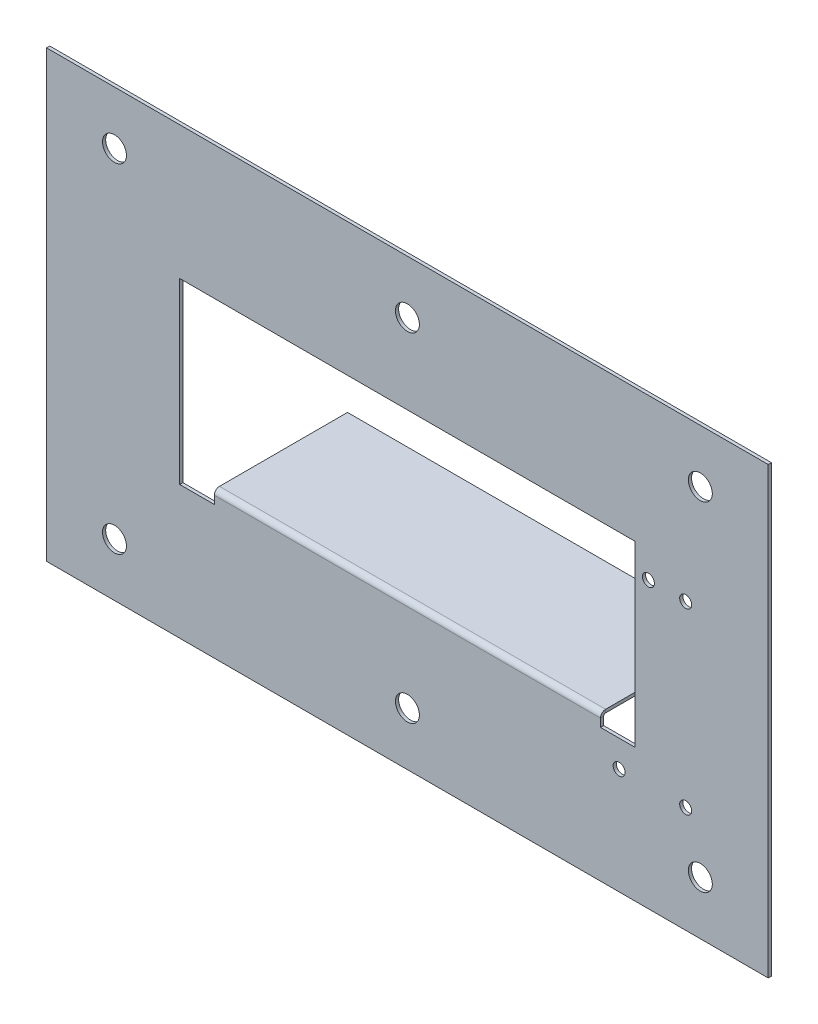
ISO-10303-21;
HEADER;
FILE_DESCRIPTION(('STEP AP214'),'2;1');
FILE_NAME('part.step','',(''),(''),'','','');
FILE_SCHEMA(('AUTOMOTIVE_DESIGN { 1 0 10303 214 1 1 1 1 }'));
ENDSEC;
DATA;
#1=APPLICATION_CONTEXT('core data for automotive mechanical design processes');
#2=APPLICATION_PROTOCOL_DEFINITION('international standard','automotive_design',2000,#1);
#3=PRODUCT_CONTEXT('',#1,'mechanical');
#4=PRODUCT('Part','Part','',(#3));
#5=PRODUCT_RELATED_PRODUCT_CATEGORY('part','',(#4));
#6=PRODUCT_DEFINITION_FORMATION('','',#4);
#7=PRODUCT_DEFINITION_CONTEXT('part definition',#1,'design');
#8=PRODUCT_DEFINITION('design','',#6,#7);
#9=PRODUCT_DEFINITION_SHAPE('','',#8);
#10=(LENGTH_UNIT() NAMED_UNIT(*) SI_UNIT(.MILLI.,.METRE.));
#11=(NAMED_UNIT(*) PLANE_ANGLE_UNIT() SI_UNIT($,.RADIAN.));
#12=(NAMED_UNIT(*) SI_UNIT($,.STERADIAN.) SOLID_ANGLE_UNIT());
#13=UNCERTAINTY_MEASURE_WITH_UNIT(LENGTH_MEASURE(1.E-05),#10,'distance_accuracy_value','');
#14=(GEOMETRIC_REPRESENTATION_CONTEXT(3) GLOBAL_UNCERTAINTY_ASSIGNED_CONTEXT((#13)) GLOBAL_UNIT_ASSIGNED_CONTEXT((#10,
#11,#12)) REPRESENTATION_CONTEXT('',''));
#15=CARTESIAN_POINT('',(0.,0.,0.));
#16=DIRECTION('',(0.,0.,1.));
#17=DIRECTION('',(1.,0.,0.));
#18=AXIS2_PLACEMENT_3D('',#15,#16,#17);
#19=CARTESIAN_POINT('',(-50.,114.,-1.2));
#20=DIRECTION('',(-1.,0.,0.));
#21=DIRECTION('',(0.,-1.,0.));
#22=AXIS2_PLACEMENT_3D('',#19,#20,#21);
#23=PLANE('',#22);
#24=DIRECTION('',(0.,-1.,0.));
#25=VECTOR('',#24,1.);
#26=CARTESIAN_POINT('',(-50.,114.,0.));
#27=LINE('',#26,#25);
#28=CARTESIAN_POINT('',(-50.,114.,0.));
#29=VERTEX_POINT('',#28);
#30=CARTESIAN_POINT('',(-50.,-53.,0.));
#31=VERTEX_POINT('',#30);
#32=EDGE_CURVE('E296',#29,#31,#27,.T.);
#33=ORIENTED_EDGE('',*,*,#32,.F.);
#34=DIRECTION('',(0.,0.,1.));
#35=VECTOR('',#34,1.);
#36=CARTESIAN_POINT('',(-50.,114.,-1.2));
#37=LINE('',#36,#35);
#38=CARTESIAN_POINT('',(-50.,114.,-1.2));
#39=VERTEX_POINT('',#38);
#40=EDGE_CURVE('E13',#39,#29,#37,.T.);
#41=ORIENTED_EDGE('',*,*,#40,.F.);
#42=DIRECTION('',(0.,-1.,0.));
#43=VECTOR('',#42,1.);
#44=CARTESIAN_POINT('',(-50.,114.,-1.2));
#45=LINE('',#44,#43);
#46=CARTESIAN_POINT('',(-50.,-53.,-1.2));
#47=VERTEX_POINT('',#46);
#48=EDGE_CURVE('E312',#39,#47,#45,.T.);
#49=ORIENTED_EDGE('',*,*,#48,.T.);
#50=DIRECTION('',(0.,0.,1.));
#51=VECTOR('',#50,1.);
#52=CARTESIAN_POINT('',(-50.,-53.,-1.2));
#53=LINE('',#52,#51);
#54=EDGE_CURVE('E62',#47,#31,#53,.T.);
#55=ORIENTED_EDGE('',*,*,#54,.T.);
#56=EDGE_LOOP('',(#33,#41,#49,#55));
#57=FACE_BOUND('',#56,.T.);
#58=ADVANCED_FACE('F59',(#57),#23,.T.);
#59=CARTESIAN_POINT('',(-50.,114.,-1.2));
#60=DIRECTION('',(0.,1.,0.));
#61=DIRECTION('',(0.,0.,1.));
#62=AXIS2_PLACEMENT_3D('',#59,#60,#61);
#63=PLANE('',#62);
#64=DIRECTION('',(-1.,0.,0.));
#65=VECTOR('',#64,1.);
#66=CARTESIAN_POINT('',(-50.,114.,0.));
#67=LINE('',#66,#65);
#68=CARTESIAN_POINT('',(221.,114.,0.));
#69=VERTEX_POINT('',#68);
#70=EDGE_CURVE('E316',#69,#29,#67,.T.);
#71=ORIENTED_EDGE('',*,*,#70,.F.);
#72=DIRECTION('',(0.,0.,1.));
#73=VECTOR('',#72,1.);
#74=CARTESIAN_POINT('',(221.,114.,-1.2));
#75=LINE('',#74,#73);
#76=CARTESIAN_POINT('',(221.,114.,-1.2));
#77=VERTEX_POINT('',#76);
#78=EDGE_CURVE('E67',#77,#69,#75,.T.);
#79=ORIENTED_EDGE('',*,*,#78,.F.);
#80=DIRECTION('',(-1.,0.,0.));
#81=VECTOR('',#80,1.);
#82=CARTESIAN_POINT('',(-50.,114.,-1.2));
#83=LINE('',#82,#81);
#84=EDGE_CURVE('E322',#77,#39,#83,.T.);
#85=ORIENTED_EDGE('',*,*,#84,.T.);
#86=ORIENTED_EDGE('',*,*,#40,.T.);
#87=EDGE_LOOP('',(#71,#79,#85,#86));
#88=FACE_BOUND('',#87,.T.);
#89=ADVANCED_FACE('F348',(#88),#63,.T.);
#90=CARTESIAN_POINT('',(221.,114.,-1.2));
#91=DIRECTION('',(1.,0.,0.));
#92=DIRECTION('',(0.,1.,0.));
#93=AXIS2_PLACEMENT_3D('',#90,#91,#92);
#94=PLANE('',#93);
#95=DIRECTION('',(0.,1.,0.));
#96=VECTOR('',#95,1.);
#97=CARTESIAN_POINT('',(221.,114.,0.));
#98=LINE('',#97,#96);
#99=CARTESIAN_POINT('',(221.,-53.,0.));
#100=VERTEX_POINT('',#99);
#101=EDGE_CURVE('E330',#100,#69,#98,.T.);
#102=ORIENTED_EDGE('',*,*,#101,.F.);
#103=DIRECTION('',(0.,0.,1.));
#104=VECTOR('',#103,1.);
#105=CARTESIAN_POINT('',(221.,-53.,-1.2));
#106=LINE('',#105,#104);
#107=CARTESIAN_POINT('',(221.,-53.,-1.2));
#108=VERTEX_POINT('',#107);
#109=EDGE_CURVE('E335',#108,#100,#106,.T.);
#110=ORIENTED_EDGE('',*,*,#109,.F.);
#111=DIRECTION('',(0.,1.,0.));
#112=VECTOR('',#111,1.);
#113=CARTESIAN_POINT('',(221.,114.,-1.2));
#114=LINE('',#113,#112);
#115=EDGE_CURVE('E319',#108,#77,#114,.T.);
#116=ORIENTED_EDGE('',*,*,#115,.T.);
#117=ORIENTED_EDGE('',*,*,#78,.T.);
#118=EDGE_LOOP('',(#102,#110,#116,#117));
#119=FACE_BOUND('',#118,.T.);
#120=ADVANCED_FACE('F354',(#119),#94,.T.);
#121=CARTESIAN_POINT('',(-50.,-53.,-1.2));
#122=DIRECTION('',(0.,-1.,0.));
#123=DIRECTION('',(0.,0.,-1.));
#124=AXIS2_PLACEMENT_3D('',#121,#122,#123);
#125=PLANE('',#124);
#126=DIRECTION('',(1.,0.,0.));
#127=VECTOR('',#126,1.);
#128=CARTESIAN_POINT('',(-50.,-53.,0.));
#129=LINE('',#128,#127);
#130=EDGE_CURVE('E327',#31,#100,#129,.T.);
#131=ORIENTED_EDGE('',*,*,#130,.F.);
#132=ORIENTED_EDGE('',*,*,#54,.F.);
#133=DIRECTION('',(1.,0.,0.));
#134=VECTOR('',#133,1.);
#135=CARTESIAN_POINT('',(-50.,-53.,-1.2));
#136=LINE('',#135,#134);
#137=EDGE_CURVE('E315',#47,#108,#136,.T.);
#138=ORIENTED_EDGE('',*,*,#137,.T.);
#139=ORIENTED_EDGE('',*,*,#109,.T.);
#140=EDGE_LOOP('',(#131,#132,#138,#139));
#141=FACE_BOUND('',#140,.T.);
#142=ADVANCED_FACE('F343',(#141),#125,.T.);
#143=CARTESIAN_POINT('',(0.,0.,-1.2));
#144=DIRECTION('',(0.,0.,1.));
#145=DIRECTION('',(1.,0.,0.));
#146=AXIS2_PLACEMENT_3D('',#143,#144,#145);
#147=PLANE('',#146);
#148=CARTESIAN_POINT('',(195.5,-33.,-1.2));
#149=DIRECTION('',(0.,0.,1.));
#150=DIRECTION('',(1.,0.,0.));
#151=AXIS2_PLACEMENT_3D('',#148,#149,#150);
#152=CIRCLE('',#151,4.49999999999999);
#153=CARTESIAN_POINT('',(200.,-33.,-1.2));
#154=VERTEX_POINT('',#153);
#155=EDGE_CURVE('E731',#154,#154,#152,.F.);
#156=ORIENTED_EDGE('',*,*,#155,.F.);
#157=EDGE_LOOP('',(#156));
#158=FACE_BOUND('',#157,.T.);
#159=CARTESIAN_POINT('',(195.5,94.,-1.2));
#160=DIRECTION('',(0.,0.,1.));
#161=DIRECTION('',(1.,0.,0.));
#162=AXIS2_PLACEMENT_3D('',#159,#160,#161);
#163=CIRCLE('',#162,4.49999999999999);
#164=CARTESIAN_POINT('',(200.,94.,-1.2));
#165=VERTEX_POINT('',#164);
#166=EDGE_CURVE('E735',#165,#165,#163,.F.);
#167=ORIENTED_EDGE('',*,*,#166,.F.);
#168=EDGE_LOOP('',(#167));
#169=FACE_BOUND('',#168,.T.);
#170=CARTESIAN_POINT('',(85.5,94.,-1.2));
#171=DIRECTION('',(0.,0.,1.));
#172=DIRECTION('',(1.,0.,0.));
#173=AXIS2_PLACEMENT_3D('',#170,#171,#172);
#174=CIRCLE('',#173,4.50000000000001);
#175=CARTESIAN_POINT('',(90.,94.,-1.2));
#176=VERTEX_POINT('',#175);
#177=EDGE_CURVE('E751',#176,#176,#174,.F.);
#178=ORIENTED_EDGE('',*,*,#177,.F.);
#179=EDGE_LOOP('',(#178));
#180=FACE_BOUND('',#179,.T.);
#181=CARTESIAN_POINT('',(85.5,-33.,-1.2));
#182=DIRECTION('',(0.,0.,1.));
#183=DIRECTION('',(1.,0.,0.));
#184=AXIS2_PLACEMENT_3D('',#181,#182,#183);
#185=CIRCLE('',#184,4.50000000000001);
#186=CARTESIAN_POINT('',(90.,-33.,-1.2));
#187=VERTEX_POINT('',#186);
#188=EDGE_CURVE('E744',#187,#187,#185,.F.);
#189=ORIENTED_EDGE('',*,*,#188,.F.);
#190=EDGE_LOOP('',(#189));
#191=FACE_BOUND('',#190,.T.);
#192=CARTESIAN_POINT('',(-24.5,94.,-1.2));
#193=DIRECTION('',(0.,0.,1.));
#194=DIRECTION('',(1.,0.,0.));
#195=AXIS2_PLACEMENT_3D('',#192,#193,#194);
#196=CIRCLE('',#195,4.50000000000001);
#197=CARTESIAN_POINT('',(-20.,94.,-1.2));
#198=VERTEX_POINT('',#197);
#199=EDGE_CURVE('E743',#198,#198,#196,.F.);
#200=ORIENTED_EDGE('',*,*,#199,.F.);
#201=EDGE_LOOP('',(#200));
#202=FACE_BOUND('',#201,.T.);
#203=CARTESIAN_POINT('',(-24.5,-33.,-1.2));
#204=DIRECTION('',(0.,0.,1.));
#205=DIRECTION('',(1.,0.,0.));
#206=AXIS2_PLACEMENT_3D('',#203,#204,#205);
#207=CIRCLE('',#206,4.50000000000001);
#208=CARTESIAN_POINT('',(-20.,-33.,-1.2));
#209=VERTEX_POINT('',#208);
#210=EDGE_CURVE('E214',#209,#209,#207,.F.);
#211=ORIENTED_EDGE('',*,*,#210,.F.);
#212=EDGE_LOOP('',(#211));
#213=FACE_BOUND('',#212,.T.);
#214=CARTESIAN_POINT('',(190.000000000003,-13.0633999999977,-1.2));
#215=DIRECTION('',(0.,0.,1.));
#216=DIRECTION('',(1.,0.,0.));
#217=AXIS2_PLACEMENT_3D('',#214,#215,#216);
#218=CIRCLE('',#217,2.25000000000001);
#219=CARTESIAN_POINT('',(192.250000000003,-13.0633999999977,-1.2));
#220=VERTEX_POINT('',#219);
#221=EDGE_CURVE('E228',#220,#220,#218,.T.);
#222=ORIENTED_EDGE('',*,*,#221,.T.);
#223=EDGE_LOOP('',(#222));
#224=FACE_BOUND('',#223,.T.);
#225=CARTESIAN_POINT('',(165.000000000003,-13.0633999999974,-1.2));
#226=DIRECTION('',(0.,0.,1.));
#227=DIRECTION('',(1.,0.,0.));
#228=AXIS2_PLACEMENT_3D('',#225,#226,#227);
#229=CIRCLE('',#228,2.25000000000001);
#230=CARTESIAN_POINT('',(167.250000000003,-13.0633999999974,-1.2));
#231=VERTEX_POINT('',#230);
#232=EDGE_CURVE('E234',#231,#231,#229,.T.);
#233=ORIENTED_EDGE('',*,*,#232,.T.);
#234=EDGE_LOOP('',(#233));
#235=FACE_BOUND('',#234,.T.);
#236=CARTESIAN_POINT('',(190.000000000004,53.9366000000023,-1.2));
#237=DIRECTION('',(0.,0.,1.));
#238=DIRECTION('',(1.,0.,0.));
#239=AXIS2_PLACEMENT_3D('',#236,#237,#238);
#240=CIRCLE('',#239,2.25000000000001);
#241=CARTESIAN_POINT('',(192.250000000004,53.9366000000023,-1.2));
#242=VERTEX_POINT('',#241);
#243=EDGE_CURVE('E240',#242,#242,#240,.T.);
#244=ORIENTED_EDGE('',*,*,#243,.T.);
#245=EDGE_LOOP('',(#244));
#246=FACE_BOUND('',#245,.T.);
#247=CARTESIAN_POINT('',(176.000000000004,53.9366000000025,-1.2));
#248=DIRECTION('',(0.,0.,1.));
#249=DIRECTION('',(1.,0.,0.));
#250=AXIS2_PLACEMENT_3D('',#247,#248,#249);
#251=CIRCLE('',#250,2.25000000000001);
#252=CARTESIAN_POINT('',(178.250000000004,53.9366000000025,-1.2));
#253=VERTEX_POINT('',#252);
#254=EDGE_CURVE('E246',#253,#253,#251,.T.);
#255=ORIENTED_EDGE('',*,*,#254,.T.);
#256=EDGE_LOOP('',(#255));
#257=FACE_BOUND('',#256,.T.);
#258=DIRECTION('',(-1.,0.,0.));
#259=VECTOR('',#258,1.);
#260=CARTESIAN_POINT('',(0.,64.,-1.2));
#261=LINE('',#260,#259);
#262=CARTESIAN_POINT('',(171.,64.,-1.2));
#263=VERTEX_POINT('',#262);
#264=CARTESIAN_POINT('',(0.,64.,-1.2));
#265=VERTEX_POINT('',#264);
#266=EDGE_CURVE('E272',#263,#265,#261,.T.);
#267=ORIENTED_EDGE('',*,*,#266,.T.);
#268=DIRECTION('',(0.,-1.,0.));
#269=VECTOR('',#268,1.);
#270=CARTESIAN_POINT('',(0.,0.,-1.2));
#271=LINE('',#270,#269);
#272=CARTESIAN_POINT('',(0.,-3.,-1.2));
#273=VERTEX_POINT('',#272);
#274=EDGE_CURVE('E252',#265,#273,#271,.T.);
#275=ORIENTED_EDGE('',*,*,#274,.T.);
#276=DIRECTION('',(1.,0.,0.));
#277=VECTOR('',#276,1.);
#278=CARTESIAN_POINT('',(0.,-3.,-1.2));
#279=LINE('',#278,#277);
#280=CARTESIAN_POINT('',(13.,-3.,-1.2));
#281=VERTEX_POINT('',#280);
#282=EDGE_CURVE('E255',#273,#281,#279,.T.);
#283=ORIENTED_EDGE('',*,*,#282,.T.);
#284=DIRECTION('',(0.,1.,0.));
#285=VECTOR('',#284,1.);
#286=CARTESIAN_POINT('',(13.,0.,-1.2));
#287=LINE('',#286,#285);
#288=CARTESIAN_POINT('',(13.,0.,-1.2));
#289=VERTEX_POINT('',#288);
#290=EDGE_CURVE('E75',#281,#289,#287,.T.);
#291=ORIENTED_EDGE('',*,*,#290,.T.);
#292=DIRECTION('',(1.,0.,0.));
#293=VECTOR('',#292,1.);
#294=CARTESIAN_POINT('',(13.,0.,-1.2));
#295=LINE('',#294,#293);
#296=CARTESIAN_POINT('',(158.,0.,-1.2));
#297=VERTEX_POINT('',#296);
#298=EDGE_CURVE('E260',#289,#297,#295,.T.);
#299=ORIENTED_EDGE('',*,*,#298,.T.);
#300=DIRECTION('',(0.,-1.,0.));
#301=VECTOR('',#300,1.);
#302=CARTESIAN_POINT('',(158.,0.,-1.2));
#303=LINE('',#302,#301);
#304=CARTESIAN_POINT('',(158.,-3.,-1.2));
#305=VERTEX_POINT('',#304);
#306=EDGE_CURVE('E263',#297,#305,#303,.T.);
#307=ORIENTED_EDGE('',*,*,#306,.T.);
#308=DIRECTION('',(1.,0.,0.));
#309=VECTOR('',#308,1.);
#310=CARTESIAN_POINT('',(171.,-3.,-1.2));
#311=LINE('',#310,#309);
#312=CARTESIAN_POINT('',(171.,-3.,-1.2));
#313=VERTEX_POINT('',#312);
#314=EDGE_CURVE('E266',#305,#313,#311,.T.);
#315=ORIENTED_EDGE('',*,*,#314,.T.);
#316=DIRECTION('',(0.,1.,0.));
#317=VECTOR('',#316,1.);
#318=CARTESIAN_POINT('',(171.,0.,-1.2));
#319=LINE('',#318,#317);
#320=EDGE_CURVE('E269',#313,#263,#319,.T.);
#321=ORIENTED_EDGE('',*,*,#320,.T.);
#322=EDGE_LOOP('',(#267,#275,#283,#291,#299,#307,#315,#321));
#323=FACE_BOUND('',#322,.T.);
#324=ORIENTED_EDGE('',*,*,#48,.F.);
#325=ORIENTED_EDGE('',*,*,#84,.F.);
#326=ORIENTED_EDGE('',*,*,#115,.F.);
#327=ORIENTED_EDGE('',*,*,#137,.F.);
#328=EDGE_LOOP('',(#324,#325,#326,#327));
#329=FACE_BOUND('',#328,.T.);
#330=ADVANCED_FACE('F351',(#158,#169,#180,#191,#202,#213,#224,#235,#246,#257,#323,#329),#147,.F.);
#331=CARTESIAN_POINT('',(0.,0.,0.));
#332=DIRECTION('',(0.,0.,1.));
#333=DIRECTION('',(1.,0.,0.));
#334=AXIS2_PLACEMENT_3D('',#331,#332,#333);
#335=PLANE('',#334);
#336=CARTESIAN_POINT('',(195.5,-33.,0.));
#337=DIRECTION('',(0.,0.,1.));
#338=DIRECTION('',(1.,0.,0.));
#339=AXIS2_PLACEMENT_3D('',#336,#337,#338);
#340=CIRCLE('',#339,4.49999999999999);
#341=CARTESIAN_POINT('',(200.,-33.,0.));
#342=VERTEX_POINT('',#341);
#343=EDGE_CURVE('E728',#342,#342,#340,.T.);
#344=ORIENTED_EDGE('',*,*,#343,.F.);
#345=EDGE_LOOP('',(#344));
#346=FACE_BOUND('',#345,.T.);
#347=CARTESIAN_POINT('',(195.5,94.,0.));
#348=DIRECTION('',(0.,0.,1.));
#349=DIRECTION('',(1.,0.,0.));
#350=AXIS2_PLACEMENT_3D('',#347,#348,#349);
#351=CIRCLE('',#350,4.49999999999999);
#352=CARTESIAN_POINT('',(200.,94.,0.));
#353=VERTEX_POINT('',#352);
#354=EDGE_CURVE('E732',#353,#353,#351,.T.);
#355=ORIENTED_EDGE('',*,*,#354,.F.);
#356=EDGE_LOOP('',(#355));
#357=FACE_BOUND('',#356,.T.);
#358=CARTESIAN_POINT('',(85.5,94.,0.));
#359=DIRECTION('',(0.,0.,1.));
#360=DIRECTION('',(1.,0.,0.));
#361=AXIS2_PLACEMENT_3D('',#358,#359,#360);
#362=CIRCLE('',#361,4.50000000000001);
#363=CARTESIAN_POINT('',(90.,94.,0.));
#364=VERTEX_POINT('',#363);
#365=EDGE_CURVE('E812',#364,#364,#362,.T.);
#366=ORIENTED_EDGE('',*,*,#365,.F.);
#367=EDGE_LOOP('',(#366));
#368=FACE_BOUND('',#367,.T.);
#369=CARTESIAN_POINT('',(85.5,-33.,0.));
#370=DIRECTION('',(0.,0.,1.));
#371=DIRECTION('',(1.,0.,0.));
#372=AXIS2_PLACEMENT_3D('',#369,#370,#371);
#373=CIRCLE('',#372,4.50000000000001);
#374=CARTESIAN_POINT('',(90.,-33.,0.));
#375=VERTEX_POINT('',#374);
#376=EDGE_CURVE('E748',#375,#375,#373,.T.);
#377=ORIENTED_EDGE('',*,*,#376,.F.);
#378=EDGE_LOOP('',(#377));
#379=FACE_BOUND('',#378,.T.);
#380=CARTESIAN_POINT('',(-24.5,94.,0.));
#381=DIRECTION('',(0.,0.,1.));
#382=DIRECTION('',(1.,0.,0.));
#383=AXIS2_PLACEMENT_3D('',#380,#381,#382);
#384=CIRCLE('',#383,4.50000000000001);
#385=CARTESIAN_POINT('',(-20.,94.,0.));
#386=VERTEX_POINT('',#385);
#387=EDGE_CURVE('E740',#386,#386,#384,.T.);
#388=ORIENTED_EDGE('',*,*,#387,.F.);
#389=EDGE_LOOP('',(#388));
#390=FACE_BOUND('',#389,.T.);
#391=CARTESIAN_POINT('',(-24.5,-33.,0.));
#392=DIRECTION('',(0.,0.,1.));
#393=DIRECTION('',(1.,0.,0.));
#394=AXIS2_PLACEMENT_3D('',#391,#392,#393);
#395=CIRCLE('',#394,4.50000000000001);
#396=CARTESIAN_POINT('',(-20.,-33.,0.));
#397=VERTEX_POINT('',#396);
#398=EDGE_CURVE('E747',#397,#397,#395,.T.);
#399=ORIENTED_EDGE('',*,*,#398,.F.);
#400=EDGE_LOOP('',(#399));
#401=FACE_BOUND('',#400,.T.);
#402=CARTESIAN_POINT('',(190.000000000003,-13.0633999999977,0.));
#403=DIRECTION('',(0.,0.,1.));
#404=DIRECTION('',(1.,0.,0.));
#405=AXIS2_PLACEMENT_3D('',#402,#403,#404);
#406=CIRCLE('',#405,2.25000000000001);
#407=CARTESIAN_POINT('',(192.250000000003,-13.0633999999977,0.));
#408=VERTEX_POINT('',#407);
#409=EDGE_CURVE('E218',#408,#408,#406,.T.);
#410=ORIENTED_EDGE('',*,*,#409,.F.);
#411=EDGE_LOOP('',(#410));
#412=FACE_BOUND('',#411,.T.);
#413=CARTESIAN_POINT('',(165.000000000003,-13.0633999999974,0.));
#414=DIRECTION('',(0.,0.,1.));
#415=DIRECTION('',(1.,0.,0.));
#416=AXIS2_PLACEMENT_3D('',#413,#414,#415);
#417=CIRCLE('',#416,2.25000000000001);
#418=CARTESIAN_POINT('',(167.250000000003,-13.0633999999974,0.));
#419=VERTEX_POINT('',#418);
#420=EDGE_CURVE('E231',#419,#419,#417,.T.);
#421=ORIENTED_EDGE('',*,*,#420,.F.);
#422=EDGE_LOOP('',(#421));
#423=FACE_BOUND('',#422,.T.);
#424=CARTESIAN_POINT('',(190.000000000004,53.9366000000023,0.));
#425=DIRECTION('',(0.,0.,1.));
#426=DIRECTION('',(1.,0.,0.));
#427=AXIS2_PLACEMENT_3D('',#424,#425,#426);
#428=CIRCLE('',#427,2.25000000000001);
#429=CARTESIAN_POINT('',(192.250000000004,53.9366000000023,0.));
#430=VERTEX_POINT('',#429);
#431=EDGE_CURVE('E237',#430,#430,#428,.T.);
#432=ORIENTED_EDGE('',*,*,#431,.F.);
#433=EDGE_LOOP('',(#432));
#434=FACE_BOUND('',#433,.T.);
#435=CARTESIAN_POINT('',(176.000000000004,53.9366000000025,0.));
#436=DIRECTION('',(0.,0.,1.));
#437=DIRECTION('',(1.,0.,0.));
#438=AXIS2_PLACEMENT_3D('',#435,#436,#437);
#439=CIRCLE('',#438,2.25000000000001);
#440=CARTESIAN_POINT('',(178.250000000004,53.9366000000025,0.));
#441=VERTEX_POINT('',#440);
#442=EDGE_CURVE('E243',#441,#441,#439,.T.);
#443=ORIENTED_EDGE('',*,*,#442,.F.);
#444=EDGE_LOOP('',(#443));
#445=FACE_BOUND('',#444,.T.);
#446=DIRECTION('',(0.,-1.,0.));
#447=VECTOR('',#446,1.);
#448=CARTESIAN_POINT('',(0.,0.,0.));
#449=LINE('',#448,#447);
#450=CARTESIAN_POINT('',(0.,64.,0.));
#451=VERTEX_POINT('',#450);
#452=CARTESIAN_POINT('',(0.,-3.,0.));
#453=VERTEX_POINT('',#452);
#454=EDGE_CURVE('E256',#451,#453,#449,.T.);
#455=ORIENTED_EDGE('',*,*,#454,.F.);
#456=DIRECTION('',(-1.,0.,0.));
#457=VECTOR('',#456,1.);
#458=CARTESIAN_POINT('',(0.,64.,0.));
#459=LINE('',#458,#457);
#460=CARTESIAN_POINT('',(171.,64.,0.));
#461=VERTEX_POINT('',#460);
#462=EDGE_CURVE('E290',#461,#451,#459,.T.);
#463=ORIENTED_EDGE('',*,*,#462,.F.);
#464=DIRECTION('',(0.,1.,0.));
#465=VECTOR('',#464,1.);
#466=CARTESIAN_POINT('',(171.,0.,0.));
#467=LINE('',#466,#465);
#468=CARTESIAN_POINT('',(171.,-3.,0.));
#469=VERTEX_POINT('',#468);
#470=EDGE_CURVE('E287',#469,#461,#467,.T.);
#471=ORIENTED_EDGE('',*,*,#470,.F.);
#472=DIRECTION('',(1.,0.,0.));
#473=VECTOR('',#472,1.);
#474=CARTESIAN_POINT('',(171.,-3.,0.));
#475=LINE('',#474,#473);
#476=CARTESIAN_POINT('',(158.,-3.,0.));
#477=VERTEX_POINT('',#476);
#478=EDGE_CURVE('E284',#477,#469,#475,.T.);
#479=ORIENTED_EDGE('',*,*,#478,.F.);
#480=DIRECTION('',(0.,-1.,0.));
#481=VECTOR('',#480,1.);
#482=CARTESIAN_POINT('',(158.,0.,0.));
#483=LINE('',#482,#481);
#484=CARTESIAN_POINT('',(158.,0.,0.));
#485=VERTEX_POINT('',#484);
#486=EDGE_CURVE('E281',#485,#477,#483,.T.);
#487=ORIENTED_EDGE('',*,*,#486,.F.);
#488=DIRECTION('',(1.,0.,0.));
#489=VECTOR('',#488,1.);
#490=CARTESIAN_POINT('',(13.,0.,0.));
#491=LINE('',#490,#489);
#492=CARTESIAN_POINT('',(13.,0.,0.));
#493=VERTEX_POINT('',#492);
#494=EDGE_CURVE('E278',#493,#485,#491,.T.);
#495=ORIENTED_EDGE('',*,*,#494,.F.);
#496=DIRECTION('',(0.,1.,0.));
#497=VECTOR('',#496,1.);
#498=CARTESIAN_POINT('',(13.,0.,0.));
#499=LINE('',#498,#497);
#500=CARTESIAN_POINT('',(13.,-3.,0.));
#501=VERTEX_POINT('',#500);
#502=EDGE_CURVE('E276',#501,#493,#499,.T.);
#503=ORIENTED_EDGE('',*,*,#502,.F.);
#504=DIRECTION('',(1.,0.,0.));
#505=VECTOR('',#504,1.);
#506=CARTESIAN_POINT('',(0.,-3.,0.));
#507=LINE('',#506,#505);
#508=EDGE_CURVE('E249',#453,#501,#507,.T.);
#509=ORIENTED_EDGE('',*,*,#508,.F.);
#510=EDGE_LOOP('',(#455,#463,#471,#479,#487,#495,#503,#509));
#511=FACE_BOUND('',#510,.T.);
#512=ORIENTED_EDGE('',*,*,#32,.T.);
#513=ORIENTED_EDGE('',*,*,#130,.T.);
#514=ORIENTED_EDGE('',*,*,#101,.T.);
#515=ORIENTED_EDGE('',*,*,#70,.T.);
#516=EDGE_LOOP('',(#512,#513,#514,#515));
#517=FACE_BOUND('',#516,.T.);
#518=ADVANCED_FACE('F345',(#346,#357,#368,#379,#390,#401,#412,#423,#434,#445,#511,#517),#335,.T.);
#519=CARTESIAN_POINT('',(0.,0.,-1.2));
#520=DIRECTION('',(-1.,0.,0.));
#521=DIRECTION('',(0.,0.,1.));
#522=AXIS2_PLACEMENT_3D('',#519,#520,#521);
#523=PLANE('',#522);
#524=ORIENTED_EDGE('',*,*,#454,.T.);
#525=DIRECTION('',(0.,0.,1.));
#526=VECTOR('',#525,1.);
#527=CARTESIAN_POINT('',(0.,-3.,-1.2));
#528=LINE('',#527,#526);
#529=EDGE_CURVE('E83',#273,#453,#528,.T.);
#530=ORIENTED_EDGE('',*,*,#529,.F.);
#531=ORIENTED_EDGE('',*,*,#274,.F.);
#532=DIRECTION('',(0.,0.,1.));
#533=VECTOR('',#532,1.);
#534=CARTESIAN_POINT('',(0.,64.,-1.2));
#535=LINE('',#534,#533);
#536=EDGE_CURVE('E294',#265,#451,#535,.T.);
#537=ORIENTED_EDGE('',*,*,#536,.T.);
#538=EDGE_LOOP('',(#524,#530,#531,#537));
#539=FACE_BOUND('',#538,.T.);
#540=ADVANCED_FACE('F389',(#539),#523,.F.);
#541=CARTESIAN_POINT('',(0.,64.,-1.2));
#542=DIRECTION('',(0.,1.,0.));
#543=DIRECTION('',(0.,0.,1.));
#544=AXIS2_PLACEMENT_3D('',#541,#542,#543);
#545=PLANE('',#544);
#546=ORIENTED_EDGE('',*,*,#462,.T.);
#547=ORIENTED_EDGE('',*,*,#536,.F.);
#548=ORIENTED_EDGE('',*,*,#266,.F.);
#549=DIRECTION('',(0.,0.,1.));
#550=VECTOR('',#549,1.);
#551=CARTESIAN_POINT('',(171.,64.,-1.2));
#552=LINE('',#551,#550);
#553=EDGE_CURVE('E297',#263,#461,#552,.T.);
#554=ORIENTED_EDGE('',*,*,#553,.T.);
#555=EDGE_LOOP('',(#546,#547,#548,#554));
#556=FACE_BOUND('',#555,.T.);
#557=ADVANCED_FACE('F394',(#556),#545,.F.);
#558=CARTESIAN_POINT('',(171.,0.,-1.2));
#559=DIRECTION('',(1.,0.,0.));
#560=DIRECTION('',(0.,0.,-1.));
#561=AXIS2_PLACEMENT_3D('',#558,#559,#560);
#562=PLANE('',#561);
#563=ORIENTED_EDGE('',*,*,#470,.T.);
#564=ORIENTED_EDGE('',*,*,#553,.F.);
#565=ORIENTED_EDGE('',*,*,#320,.F.);
#566=DIRECTION('',(0.,0.,1.));
#567=VECTOR('',#566,1.);
#568=CARTESIAN_POINT('',(171.,-3.,-1.2));
#569=LINE('',#568,#567);
#570=EDGE_CURVE('E299',#313,#469,#569,.T.);
#571=ORIENTED_EDGE('',*,*,#570,.T.);
#572=EDGE_LOOP('',(#563,#564,#565,#571));
#573=FACE_BOUND('',#572,.T.);
#574=ADVANCED_FACE('F406',(#573),#562,.F.);
#575=CARTESIAN_POINT('',(171.,-3.,-1.2));
#576=DIRECTION('',(0.,-1.,0.));
#577=DIRECTION('',(1.,0.,0.));
#578=AXIS2_PLACEMENT_3D('',#575,#576,#577);
#579=PLANE('',#578);
#580=ORIENTED_EDGE('',*,*,#478,.T.);
#581=ORIENTED_EDGE('',*,*,#570,.F.);
#582=ORIENTED_EDGE('',*,*,#314,.F.);
#583=DIRECTION('',(0.,0.,1.));
#584=VECTOR('',#583,1.);
#585=CARTESIAN_POINT('',(158.,-3.,-1.2));
#586=LINE('',#585,#584);
#587=EDGE_CURVE('E301',#305,#477,#586,.T.);
#588=ORIENTED_EDGE('',*,*,#587,.T.);
#589=EDGE_LOOP('',(#580,#581,#582,#588));
#590=FACE_BOUND('',#589,.T.);
#591=ADVANCED_FACE('F418',(#590),#579,.F.);
#592=CARTESIAN_POINT('',(158.,0.,-1.2));
#593=DIRECTION('',(-1.,0.,0.));
#594=DIRECTION('',(0.,0.,1.));
#595=AXIS2_PLACEMENT_3D('',#592,#593,#594);
#596=PLANE('',#595);
#597=ORIENTED_EDGE('',*,*,#486,.T.);
#598=ORIENTED_EDGE('',*,*,#587,.F.);
#599=ORIENTED_EDGE('',*,*,#306,.F.);
#600=DIRECTION('',(0.,0.,1.));
#601=VECTOR('',#600,1.);
#602=CARTESIAN_POINT('',(158.,0.,-1.2));
#603=LINE('',#602,#601);
#604=EDGE_CURVE('E303',#297,#485,#603,.T.);
#605=ORIENTED_EDGE('',*,*,#604,.T.);
#606=EDGE_LOOP('',(#597,#598,#599,#605));
#607=FACE_BOUND('',#606,.T.);
#608=ADVANCED_FACE('F428',(#607),#596,.F.);
#609=CARTESIAN_POINT('',(13.,0.,-1.2));
#610=DIRECTION('',(1.,0.,0.));
#611=DIRECTION('',(0.,1.,0.));
#612=AXIS2_PLACEMENT_3D('',#609,#610,#611);
#613=PLANE('',#612);
#614=ORIENTED_EDGE('',*,*,#502,.T.);
#615=DIRECTION('',(0.,0.,1.));
#616=VECTOR('',#615,1.);
#617=CARTESIAN_POINT('',(13.,0.,-1.2));
#618=LINE('',#617,#616);
#619=EDGE_CURVE('E306',#289,#493,#618,.T.);
#620=ORIENTED_EDGE('',*,*,#619,.F.);
#621=ORIENTED_EDGE('',*,*,#290,.F.);
#622=DIRECTION('',(0.,0.,1.));
#623=VECTOR('',#622,1.);
#624=CARTESIAN_POINT('',(13.,-3.,-1.2));
#625=LINE('',#624,#623);
#626=EDGE_CURVE('E309',#281,#501,#625,.T.);
#627=ORIENTED_EDGE('',*,*,#626,.T.);
#628=EDGE_LOOP('',(#614,#620,#621,#627));
#629=FACE_BOUND('',#628,.T.);
#630=ADVANCED_FACE('F443',(#629),#613,.F.);
#631=CARTESIAN_POINT('',(0.,-3.,-1.2));
#632=DIRECTION('',(0.,-1.,0.));
#633=DIRECTION('',(0.,0.,-1.));
#634=AXIS2_PLACEMENT_3D('',#631,#632,#633);
#635=PLANE('',#634);
#636=ORIENTED_EDGE('',*,*,#508,.T.);
#637=ORIENTED_EDGE('',*,*,#626,.F.);
#638=ORIENTED_EDGE('',*,*,#282,.F.);
#639=ORIENTED_EDGE('',*,*,#529,.T.);
#640=EDGE_LOOP('',(#636,#637,#638,#639));
#641=FACE_BOUND('',#640,.T.);
#642=ADVANCED_FACE('F437',(#641),#635,.F.);
#643=CARTESIAN_POINT('',(176.000000000004,53.9366000000025,-1.2));
#644=DIRECTION('',(0.,0.,1.));
#645=DIRECTION('',(1.,0.,0.));
#646=AXIS2_PLACEMENT_3D('',#643,#644,#645);
#647=CYLINDRICAL_SURFACE('',#646,2.25000000000001);
#648=ORIENTED_EDGE('',*,*,#254,.F.);
#649=EDGE_LOOP('',(#648));
#650=FACE_BOUND('',#649,.T.);
#651=ORIENTED_EDGE('',*,*,#442,.T.);
#652=EDGE_LOOP('',(#651));
#653=FACE_BOUND('',#652,.T.);
#654=ADVANCED_FACE('F442',(#650,#653),#647,.F.);
#655=CARTESIAN_POINT('',(190.000000000004,53.9366000000023,-1.2));
#656=DIRECTION('',(0.,0.,1.));
#657=DIRECTION('',(1.,0.,0.));
#658=AXIS2_PLACEMENT_3D('',#655,#656,#657);
#659=CYLINDRICAL_SURFACE('',#658,2.25000000000001);
#660=ORIENTED_EDGE('',*,*,#243,.F.);
#661=EDGE_LOOP('',(#660));
#662=FACE_BOUND('',#661,.T.);
#663=ORIENTED_EDGE('',*,*,#431,.T.);
#664=EDGE_LOOP('',(#663));
#665=FACE_BOUND('',#664,.T.);
#666=ADVANCED_FACE('F455',(#662,#665),#659,.F.);
#667=CARTESIAN_POINT('',(165.000000000003,-13.0633999999974,-1.2));
#668=DIRECTION('',(0.,0.,1.));
#669=DIRECTION('',(1.,0.,0.));
#670=AXIS2_PLACEMENT_3D('',#667,#668,#669);
#671=CYLINDRICAL_SURFACE('',#670,2.25000000000001);
#672=ORIENTED_EDGE('',*,*,#232,.F.);
#673=EDGE_LOOP('',(#672));
#674=FACE_BOUND('',#673,.T.);
#675=ORIENTED_EDGE('',*,*,#420,.T.);
#676=EDGE_LOOP('',(#675));
#677=FACE_BOUND('',#676,.T.);
#678=ADVANCED_FACE('F466',(#674,#677),#671,.F.);
#679=CARTESIAN_POINT('',(190.000000000003,-13.0633999999977,-1.2));
#680=DIRECTION('',(0.,0.,1.));
#681=DIRECTION('',(1.,0.,0.));
#682=AXIS2_PLACEMENT_3D('',#679,#680,#681);
#683=CYLINDRICAL_SURFACE('',#682,2.25000000000001);
#684=ORIENTED_EDGE('',*,*,#221,.F.);
#685=EDGE_LOOP('',(#684));
#686=FACE_BOUND('',#685,.T.);
#687=ORIENTED_EDGE('',*,*,#409,.T.);
#688=EDGE_LOOP('',(#687));
#689=FACE_BOUND('',#688,.T.);
#690=ADVANCED_FACE('F477',(#686,#689),#683,.F.);
#691=CARTESIAN_POINT('',(13.,0.,-1.93659999999999));
#692=DIRECTION('',(-1.,0.,0.));
#693=DIRECTION('',(0.,0.,1.));
#694=AXIS2_PLACEMENT_3D('',#691,#692,#693);
#695=PLANE('',#694);
#696=DIRECTION('',(0.,-1.,0.));
#697=VECTOR('',#696,1.);
#698=CARTESIAN_POINT('',(13.,1.93659999999998,-1.93659999999999));
#699=LINE('',#698,#697);
#700=CARTESIAN_POINT('',(13.,0.736599999999978,-1.93659999999999));
#701=VERTEX_POINT('',#700);
#702=CARTESIAN_POINT('',(13.,1.93659999999998,-1.93659999999999));
#703=VERTEX_POINT('',#702);
#704=EDGE_CURVE('E197',#701,#703,#699,.F.);
#705=ORIENTED_EDGE('',*,*,#704,.F.);
#706=CARTESIAN_POINT('',(13.,0.,-1.93659999999999));
#707=DIRECTION('',(1.,0.,0.));
#708=DIRECTION('',(0.,0.,-1.));
#709=AXIS2_PLACEMENT_3D('',#706,#707,#708);
#710=CIRCLE('',#709,0.736600000000005);
#711=EDGE_CURVE('E222',#289,#701,#710,.F.);
#712=ORIENTED_EDGE('',*,*,#711,.F.);
#713=ORIENTED_EDGE('',*,*,#619,.T.);
#714=CARTESIAN_POINT('',(13.,0.,-1.93659999999999));
#715=DIRECTION('',(1.,0.,0.));
#716=DIRECTION('',(0.,0.,-1.));
#717=AXIS2_PLACEMENT_3D('',#714,#715,#716);
#718=CIRCLE('',#717,1.9366);
#719=EDGE_CURVE('E215',#493,#703,#718,.F.);
#720=ORIENTED_EDGE('',*,*,#719,.T.);
#721=EDGE_LOOP('',(#705,#712,#713,#720));
#722=FACE_BOUND('',#721,.T.);
#723=ADVANCED_FACE('F488',(#722),#695,.T.);
#724=CARTESIAN_POINT('',(158.,0.,-1.93660000000002));
#725=DIRECTION('',(-1.,0.,0.));
#726=DIRECTION('',(0.,0.,1.));
#727=AXIS2_PLACEMENT_3D('',#724,#725,#726);
#728=PLANE('',#727);
#729=CARTESIAN_POINT('',(158.,0.,-1.93660000000002));
#730=DIRECTION('',(1.,0.,0.));
#731=DIRECTION('',(0.,0.,-1.));
#732=AXIS2_PLACEMENT_3D('',#729,#730,#731);
#733=CIRCLE('',#732,0.736600000000005);
#734=CARTESIAN_POINT('',(158.,0.736599999999988,-1.93660000000001));
#735=VERTEX_POINT('',#734);
#736=EDGE_CURVE('E225',#735,#297,#733,.T.);
#737=ORIENTED_EDGE('',*,*,#736,.F.);
#738=DIRECTION('',(0.,-1.,0.));
#739=VECTOR('',#738,1.);
#740=CARTESIAN_POINT('',(158.,0.736599999999978,-1.93660000000001));
#741=LINE('',#740,#739);
#742=CARTESIAN_POINT('',(158.,1.93659999999998,-1.9366));
#743=VERTEX_POINT('',#742);
#744=EDGE_CURVE('E208',#735,#743,#741,.F.);
#745=ORIENTED_EDGE('',*,*,#744,.T.);
#746=CARTESIAN_POINT('',(158.,0.,-1.93660000000002));
#747=DIRECTION('',(1.,0.,0.));
#748=DIRECTION('',(0.,0.,-1.));
#749=AXIS2_PLACEMENT_3D('',#746,#747,#748);
#750=CIRCLE('',#749,1.9366);
#751=EDGE_CURVE('E219',#743,#485,#750,.T.);
#752=ORIENTED_EDGE('',*,*,#751,.T.);
#753=ORIENTED_EDGE('',*,*,#604,.F.);
#754=EDGE_LOOP('',(#737,#745,#752,#753));
#755=FACE_BOUND('',#754,.T.);
#756=ADVANCED_FACE('F514',(#755),#728,.F.);
#757=CARTESIAN_POINT('',(158.,0.,-1.93660000000002));
#758=DIRECTION('',(1.,0.,0.));
#759=DIRECTION('',(0.,1.,0.));
#760=AXIS2_PLACEMENT_3D('',#757,#758,#759);
#761=CYLINDRICAL_SURFACE('',#760,1.9366);
#762=ORIENTED_EDGE('',*,*,#494,.T.);
#763=ORIENTED_EDGE('',*,*,#751,.F.);
#764=DIRECTION('',(1.,0.,0.));
#765=VECTOR('',#764,1.);
#766=CARTESIAN_POINT('',(13.,1.93659999999998,-1.93659999999999));
#767=LINE('',#766,#765);
#768=EDGE_CURVE('E206',#743,#703,#767,.F.);
#769=ORIENTED_EDGE('',*,*,#768,.T.);
#770=ORIENTED_EDGE('',*,*,#719,.F.);
#771=EDGE_LOOP('',(#762,#763,#769,#770));
#772=FACE_BOUND('',#771,.T.);
#773=ADVANCED_FACE('F525',(#772),#761,.T.);
#774=CARTESIAN_POINT('',(158.,0.,-1.93660000000002));
#775=DIRECTION('',(1.,0.,0.));
#776=DIRECTION('',(0.,1.,0.));
#777=AXIS2_PLACEMENT_3D('',#774,#775,#776);
#778=CYLINDRICAL_SURFACE('',#777,0.736600000000005);
#779=ORIENTED_EDGE('',*,*,#298,.F.);
#780=ORIENTED_EDGE('',*,*,#711,.T.);
#781=DIRECTION('',(1.,0.,0.));
#782=VECTOR('',#781,1.);
#783=CARTESIAN_POINT('',(13.,0.736599999999977,-1.9366));
#784=LINE('',#783,#782);
#785=EDGE_CURVE('E211',#701,#735,#784,.T.);
#786=ORIENTED_EDGE('',*,*,#785,.T.);
#787=ORIENTED_EDGE('',*,*,#736,.T.);
#788=EDGE_LOOP('',(#779,#780,#786,#787));
#789=FACE_BOUND('',#788,.T.);
#790=ADVANCED_FACE('F536',(#789),#778,.F.);
#791=CARTESIAN_POINT('',(13.,1.93659999999997,-1.2));
#792=DIRECTION('',(1.,0.,0.));
#793=DIRECTION('',(0.,1.,0.));
#794=AXIS2_PLACEMENT_3D('',#791,#792,#793);
#795=PLANE('',#794);
#796=ORIENTED_EDGE('',*,*,#704,.T.);
#797=DIRECTION('',(0.,0.,1.));
#798=VECTOR('',#797,1.);
#799=CARTESIAN_POINT('',(13.,1.93659999999997,0.));
#800=LINE('',#799,#798);
#801=CARTESIAN_POINT('',(13.,1.93660000000014,-50.));
#802=VERTEX_POINT('',#801);
#803=EDGE_CURVE('E178',#802,#703,#800,.T.);
#804=ORIENTED_EDGE('',*,*,#803,.F.);
#805=DIRECTION('',(0.,-1.,0.));
#806=VECTOR('',#805,1.);
#807=CARTESIAN_POINT('',(13.,1.93660000000015,-50.));
#808=LINE('',#807,#806);
#809=CARTESIAN_POINT('',(13.,0.736600000000145,-50.));
#810=VERTEX_POINT('',#809);
#811=EDGE_CURVE('E184',#802,#810,#808,.T.);
#812=ORIENTED_EDGE('',*,*,#811,.T.);
#813=DIRECTION('',(0.,0.,-1.));
#814=VECTOR('',#813,1.);
#815=CARTESIAN_POINT('',(13.,0.736599999999975,-1.2));
#816=LINE('',#815,#814);
#817=EDGE_CURVE('E204',#810,#701,#816,.F.);
#818=ORIENTED_EDGE('',*,*,#817,.T.);
#819=EDGE_LOOP('',(#796,#804,#812,#818));
#820=FACE_BOUND('',#819,.T.);
#821=ADVANCED_FACE('F196',(#820),#795,.F.);
#822=CARTESIAN_POINT('',(158.,1.93660000000015,-50.));
#823=DIRECTION('',(-1.,0.,0.));
#824=DIRECTION('',(0.,-1.,0.));
#825=AXIS2_PLACEMENT_3D('',#822,#823,#824);
#826=PLANE('',#825);
#827=ORIENTED_EDGE('',*,*,#744,.F.);
#828=DIRECTION('',(0.,0.,1.));
#829=VECTOR('',#828,1.);
#830=CARTESIAN_POINT('',(158.,0.736600000000146,-50.));
#831=LINE('',#830,#829);
#832=CARTESIAN_POINT('',(158.,0.736600000000146,-50.));
#833=VERTEX_POINT('',#832);
#834=EDGE_CURVE('E200',#735,#833,#831,.F.);
#835=ORIENTED_EDGE('',*,*,#834,.T.);
#836=DIRECTION('',(0.,-1.,0.));
#837=VECTOR('',#836,1.);
#838=CARTESIAN_POINT('',(158.,1.93660000000015,-50.));
#839=LINE('',#838,#837);
#840=CARTESIAN_POINT('',(158.,1.93660000000015,-50.));
#841=VERTEX_POINT('',#840);
#842=EDGE_CURVE('E193',#841,#833,#839,.T.);
#843=ORIENTED_EDGE('',*,*,#842,.F.);
#844=DIRECTION('',(0.,0.,-1.));
#845=VECTOR('',#844,1.);
#846=CARTESIAN_POINT('',(158.,1.93659999999997,0.));
#847=LINE('',#846,#845);
#848=EDGE_CURVE('E180',#743,#841,#847,.T.);
#849=ORIENTED_EDGE('',*,*,#848,.F.);
#850=EDGE_LOOP('',(#827,#835,#843,#849));
#851=FACE_BOUND('',#850,.T.);
#852=ADVANCED_FACE('F557',(#851),#826,.F.);
#853=CARTESIAN_POINT('',(0.,1.93659999999997,0.));
#854=DIRECTION('',(0.,-1.,0.));
#855=DIRECTION('',(0.,0.,-1.));
#856=AXIS2_PLACEMENT_3D('',#853,#854,#855);
#857=PLANE('',#856);
#858=ORIENTED_EDGE('',*,*,#768,.F.);
#859=ORIENTED_EDGE('',*,*,#848,.T.);
#860=DIRECTION('',(-1.,0.,0.));
#861=VECTOR('',#860,1.);
#862=CARTESIAN_POINT('',(0.,1.93660000000014,-50.));
#863=LINE('',#862,#861);
#864=EDGE_CURVE('E173',#841,#802,#863,.T.);
#865=ORIENTED_EDGE('',*,*,#864,.T.);
#866=ORIENTED_EDGE('',*,*,#803,.T.);
#867=EDGE_LOOP('',(#858,#859,#865,#866));
#868=FACE_BOUND('',#867,.T.);
#869=ADVANCED_FACE('F176',(#868),#857,.F.);
#870=CARTESIAN_POINT('',(0.,0.736599999999971,0.));
#871=DIRECTION('',(0.,-1.,0.));
#872=DIRECTION('',(0.,0.,-1.));
#873=AXIS2_PLACEMENT_3D('',#870,#871,#872);
#874=PLANE('',#873);
#875=ORIENTED_EDGE('',*,*,#834,.F.);
#876=ORIENTED_EDGE('',*,*,#785,.F.);
#877=ORIENTED_EDGE('',*,*,#817,.F.);
#878=DIRECTION('',(1.,0.,0.));
#879=VECTOR('',#878,1.);
#880=CARTESIAN_POINT('',(13.,0.736600000000145,-50.));
#881=LINE('',#880,#879);
#882=EDGE_CURVE('E189',#833,#810,#881,.F.);
#883=ORIENTED_EDGE('',*,*,#882,.F.);
#884=EDGE_LOOP('',(#875,#876,#877,#883));
#885=FACE_BOUND('',#884,.T.);
#886=ADVANCED_FACE('F577',(#885),#874,.T.);
#887=CARTESIAN_POINT('',(13.,1.93660000000015,-50.));
#888=DIRECTION('',(0.,0.,1.));
#889=DIRECTION('',(0.,-1.,0.));
#890=AXIS2_PLACEMENT_3D('',#887,#888,#889);
#891=PLANE('',#890);
#892=ORIENTED_EDGE('',*,*,#882,.T.);
#893=ORIENTED_EDGE('',*,*,#811,.F.);
#894=ORIENTED_EDGE('',*,*,#864,.F.);
#895=ORIENTED_EDGE('',*,*,#842,.T.);
#896=EDGE_LOOP('',(#892,#893,#894,#895));
#897=FACE_BOUND('',#896,.T.);
#898=ADVANCED_FACE('F187',(#897),#891,.F.);
#899=CARTESIAN_POINT('',(-24.5,-33.,-50.001));
#900=DIRECTION('',(0.,0.,1.));
#901=DIRECTION('',(1.,0.,0.));
#902=AXIS2_PLACEMENT_3D('',#899,#900,#901);
#903=CYLINDRICAL_SURFACE('',#902,4.50000000000001);
#904=ORIENTED_EDGE('',*,*,#398,.T.);
#905=EDGE_LOOP('',(#904));
#906=FACE_BOUND('',#905,.T.);
#907=ORIENTED_EDGE('',*,*,#210,.T.);
#908=EDGE_LOOP('',(#907));
#909=FACE_BOUND('',#908,.T.);
#910=ADVANCED_FACE('F597',(#906,#909),#903,.F.);
#911=CARTESIAN_POINT('',(-24.5,94.,-50.001));
#912=DIRECTION('',(0.,0.,1.));
#913=DIRECTION('',(1.,0.,0.));
#914=AXIS2_PLACEMENT_3D('',#911,#912,#913);
#915=CYLINDRICAL_SURFACE('',#914,4.50000000000001);
#916=ORIENTED_EDGE('',*,*,#387,.T.);
#917=EDGE_LOOP('',(#916));
#918=FACE_BOUND('',#917,.T.);
#919=ORIENTED_EDGE('',*,*,#199,.T.);
#920=EDGE_LOOP('',(#919));
#921=FACE_BOUND('',#920,.T.);
#922=ADVANCED_FACE('F624',(#918,#921),#915,.F.);
#923=CARTESIAN_POINT('',(85.5,-33.,-50.001));
#924=DIRECTION('',(0.,0.,1.));
#925=DIRECTION('',(1.,0.,0.));
#926=AXIS2_PLACEMENT_3D('',#923,#924,#925);
#927=CYLINDRICAL_SURFACE('',#926,4.50000000000001);
#928=ORIENTED_EDGE('',*,*,#376,.T.);
#929=EDGE_LOOP('',(#928));
#930=FACE_BOUND('',#929,.T.);
#931=ORIENTED_EDGE('',*,*,#188,.T.);
#932=EDGE_LOOP('',(#931));
#933=FACE_BOUND('',#932,.T.);
#934=ADVANCED_FACE('F635',(#930,#933),#927,.F.);
#935=CARTESIAN_POINT('',(85.5,94.,-50.001));
#936=DIRECTION('',(0.,0.,1.));
#937=DIRECTION('',(1.,0.,0.));
#938=AXIS2_PLACEMENT_3D('',#935,#936,#937);
#939=CYLINDRICAL_SURFACE('',#938,4.50000000000001);
#940=ORIENTED_EDGE('',*,*,#365,.T.);
#941=EDGE_LOOP('',(#940));
#942=FACE_BOUND('',#941,.T.);
#943=ORIENTED_EDGE('',*,*,#177,.T.);
#944=EDGE_LOOP('',(#943));
#945=FACE_BOUND('',#944,.T.);
#946=ADVANCED_FACE('F646',(#942,#945),#939,.F.);
#947=CARTESIAN_POINT('',(195.5,94.,-50.001));
#948=DIRECTION('',(0.,0.,1.));
#949=DIRECTION('',(1.,0.,0.));
#950=AXIS2_PLACEMENT_3D('',#947,#948,#949);
#951=CYLINDRICAL_SURFACE('',#950,4.49999999999999);
#952=ORIENTED_EDGE('',*,*,#354,.T.);
#953=EDGE_LOOP('',(#952));
#954=FACE_BOUND('',#953,.T.);
#955=ORIENTED_EDGE('',*,*,#166,.T.);
#956=EDGE_LOOP('',(#955));
#957=FACE_BOUND('',#956,.T.);
#958=ADVANCED_FACE('F657',(#954,#957),#951,.F.);
#959=CARTESIAN_POINT('',(195.5,-33.,-50.001));
#960=DIRECTION('',(0.,0.,1.));
#961=DIRECTION('',(1.,0.,0.));
#962=AXIS2_PLACEMENT_3D('',#959,#960,#961);
#963=CYLINDRICAL_SURFACE('',#962,4.49999999999999);
#964=ORIENTED_EDGE('',*,*,#343,.T.);
#965=EDGE_LOOP('',(#964));
#966=FACE_BOUND('',#965,.T.);
#967=ORIENTED_EDGE('',*,*,#155,.T.);
#968=EDGE_LOOP('',(#967));
#969=FACE_BOUND('',#968,.T.);
#970=ADVANCED_FACE('F668',(#966,#969),#963,.F.);
#971=CLOSED_SHELL('',(#58,#89,#120,#142,#330,#518,#540,#557,#574,#591,#608,#630,#642,#654,#666,
#678,#690,#723,#756,#773,#790,#821,#852,#869,#886,#898,#910,#922,#934,#946,#958,#970));
#972=MANIFOLD_SOLID_BREP('B2',#971);
#973=ADVANCED_BREP_SHAPE_REPRESENTATION('',(#18,#972),#14);
#974=SHAPE_DEFINITION_REPRESENTATION(#9,#973);
ENDSEC;
END-ISO-10303-21;
